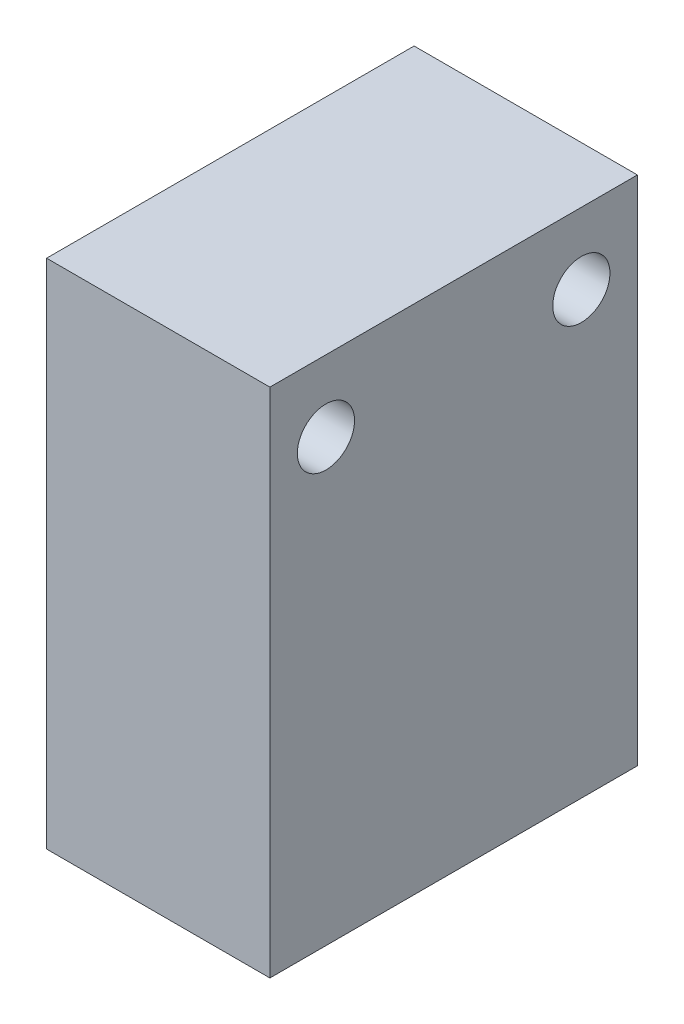
ISO-10303-21;
HEADER;
FILE_DESCRIPTION(('STEP AP214'),'2;1');
FILE_NAME('part.step','',(''),(''),'','','');
FILE_SCHEMA(('AUTOMOTIVE_DESIGN { 1 0 10303 214 1 1 1 1 }'));
ENDSEC;
DATA;
#1=APPLICATION_CONTEXT('core data for automotive mechanical design processes');
#2=APPLICATION_PROTOCOL_DEFINITION('international standard','automotive_design',2000,#1);
#3=PRODUCT_CONTEXT('',#1,'mechanical');
#4=PRODUCT('Part','Part','',(#3));
#5=PRODUCT_RELATED_PRODUCT_CATEGORY('part','',(#4));
#6=PRODUCT_DEFINITION_FORMATION('','',#4);
#7=PRODUCT_DEFINITION_CONTEXT('part definition',#1,'design');
#8=PRODUCT_DEFINITION('design','',#6,#7);
#9=PRODUCT_DEFINITION_SHAPE('','',#8);
#10=(LENGTH_UNIT() NAMED_UNIT(*) SI_UNIT(.MILLI.,.METRE.));
#11=(NAMED_UNIT(*) PLANE_ANGLE_UNIT() SI_UNIT($,.RADIAN.));
#12=(NAMED_UNIT(*) SI_UNIT($,.STERADIAN.) SOLID_ANGLE_UNIT());
#13=UNCERTAINTY_MEASURE_WITH_UNIT(LENGTH_MEASURE(1.E-05),#10,'distance_accuracy_value','');
#14=(GEOMETRIC_REPRESENTATION_CONTEXT(3) GLOBAL_UNCERTAINTY_ASSIGNED_CONTEXT((#13)) GLOBAL_UNIT_ASSIGNED_CONTEXT((#10,
#11,#12)) REPRESENTATION_CONTEXT('',''));
#15=CARTESIAN_POINT('',(0.,0.,0.));
#16=DIRECTION('',(0.,0.,1.));
#17=DIRECTION('',(1.,0.,0.));
#18=AXIS2_PLACEMENT_3D('',#15,#16,#17);
#19=CARTESIAN_POINT('',(6.096,27.94,10.033));
#20=DIRECTION('',(-1.,0.,0.));
#21=DIRECTION('',(0.,0.,1.));
#22=AXIS2_PLACEMENT_3D('',#19,#20,#21);
#23=PLANE('',#22);
#24=CARTESIAN_POINT('',(6.096,24.0538,-6.9723));
#25=DIRECTION('',(-1.,0.,0.));
#26=DIRECTION('',(0.,0.,1.));
#27=AXIS2_PLACEMENT_3D('',#24,#25,#26);
#28=CIRCLE('',#27,1.5621);
#29=CARTESIAN_POINT('',(6.096,24.0538,-5.4102));
#30=VERTEX_POINT('',#29);
#31=EDGE_CURVE('E126',#30,#30,#28,.T.);
#32=ORIENTED_EDGE('',*,*,#31,.T.);
#33=EDGE_LOOP('',(#32));
#34=FACE_BOUND('',#33,.T.);
#35=CARTESIAN_POINT('',(6.096,24.0538,6.9723));
#36=DIRECTION('',(-1.,0.,0.));
#37=DIRECTION('',(0.,0.,1.));
#38=AXIS2_PLACEMENT_3D('',#35,#36,#37);
#39=CIRCLE('',#38,1.5621);
#40=CARTESIAN_POINT('',(6.096,24.0538,8.5344));
#41=VERTEX_POINT('',#40);
#42=EDGE_CURVE('E133',#41,#41,#39,.T.);
#43=ORIENTED_EDGE('',*,*,#42,.T.);
#44=EDGE_LOOP('',(#43));
#45=FACE_BOUND('',#44,.T.);
#46=DIRECTION('',(0.,0.,-1.));
#47=VECTOR('',#46,1.);
#48=CARTESIAN_POINT('',(6.096,0.,10.033));
#49=LINE('',#48,#47);
#50=CARTESIAN_POINT('',(6.096,0.,10.033));
#51=VERTEX_POINT('',#50);
#52=CARTESIAN_POINT('',(6.096,0.,-10.033));
#53=VERTEX_POINT('',#52);
#54=EDGE_CURVE('E110',#51,#53,#49,.T.);
#55=ORIENTED_EDGE('',*,*,#54,.T.);
#56=DIRECTION('',(0.,-1.,0.));
#57=VECTOR('',#56,1.);
#58=CARTESIAN_POINT('',(6.096,27.94,-10.033));
#59=LINE('',#58,#57);
#60=CARTESIAN_POINT('',(6.096,27.94,-10.033));
#61=VERTEX_POINT('',#60);
#62=EDGE_CURVE('E11',#61,#53,#59,.T.);
#63=ORIENTED_EDGE('',*,*,#62,.F.);
#64=DIRECTION('',(0.,0.,-1.));
#65=VECTOR('',#64,1.);
#66=CARTESIAN_POINT('',(6.096,27.94,10.033));
#67=LINE('',#66,#65);
#68=CARTESIAN_POINT('',(6.096,27.94,10.033));
#69=VERTEX_POINT('',#68);
#70=EDGE_CURVE('E93',#69,#61,#67,.T.);
#71=ORIENTED_EDGE('',*,*,#70,.F.);
#72=DIRECTION('',(0.,-1.,0.));
#73=VECTOR('',#72,1.);
#74=CARTESIAN_POINT('',(6.096,27.94,10.033));
#75=LINE('',#74,#73);
#76=EDGE_CURVE('E106',#69,#51,#75,.T.);
#77=ORIENTED_EDGE('',*,*,#76,.T.);
#78=EDGE_LOOP('',(#55,#63,#71,#77));
#79=FACE_BOUND('',#78,.T.);
#80=ADVANCED_FACE('F39',(#34,#45,#79),#23,.F.);
#81=CARTESIAN_POINT('',(-6.096,27.94,-10.033));
#82=DIRECTION('',(0.,0.,1.));
#83=DIRECTION('',(1.,0.,0.));
#84=AXIS2_PLACEMENT_3D('',#81,#82,#83);
#85=PLANE('',#84);
#86=DIRECTION('',(-1.,0.,0.));
#87=VECTOR('',#86,1.);
#88=CARTESIAN_POINT('',(-6.096,0.,-10.033));
#89=LINE('',#88,#87);
#90=CARTESIAN_POINT('',(-6.096,0.,-10.033));
#91=VERTEX_POINT('',#90);
#92=EDGE_CURVE('E98',#53,#91,#89,.T.);
#93=ORIENTED_EDGE('',*,*,#92,.T.);
#94=DIRECTION('',(0.,-1.,0.));
#95=VECTOR('',#94,1.);
#96=CARTESIAN_POINT('',(-6.096,27.94,-10.033));
#97=LINE('',#96,#95);
#98=CARTESIAN_POINT('',(-6.096,27.94,-10.033));
#99=VERTEX_POINT('',#98);
#100=EDGE_CURVE('E49',#99,#91,#97,.T.);
#101=ORIENTED_EDGE('',*,*,#100,.F.);
#102=DIRECTION('',(-1.,0.,0.));
#103=VECTOR('',#102,1.);
#104=CARTESIAN_POINT('',(-6.096,27.94,-10.033));
#105=LINE('',#104,#103);
#106=EDGE_CURVE('E88',#61,#99,#105,.T.);
#107=ORIENTED_EDGE('',*,*,#106,.F.);
#108=ORIENTED_EDGE('',*,*,#62,.T.);
#109=EDGE_LOOP('',(#93,#101,#107,#108));
#110=FACE_BOUND('',#109,.T.);
#111=ADVANCED_FACE('F97',(#110),#85,.F.);
#112=CARTESIAN_POINT('',(-6.096,27.94,10.033));
#113=DIRECTION('',(1.,0.,0.));
#114=DIRECTION('',(0.,0.,-1.));
#115=AXIS2_PLACEMENT_3D('',#112,#113,#114);
#116=PLANE('',#115);
#117=CARTESIAN_POINT('',(-6.096,24.0538,-6.9723));
#118=DIRECTION('',(1.,0.,0.));
#119=DIRECTION('',(0.,0.,-1.));
#120=AXIS2_PLACEMENT_3D('',#117,#118,#119);
#121=CIRCLE('',#120,1.5621);
#122=CARTESIAN_POINT('',(-6.096,24.0538,-8.5344));
#123=VERTEX_POINT('',#122);
#124=EDGE_CURVE('E42',#123,#123,#121,.T.);
#125=ORIENTED_EDGE('',*,*,#124,.T.);
#126=EDGE_LOOP('',(#125));
#127=FACE_BOUND('',#126,.T.);
#128=CARTESIAN_POINT('',(-6.096,24.0538,6.9723));
#129=DIRECTION('',(1.,0.,0.));
#130=DIRECTION('',(0.,0.,-1.));
#131=AXIS2_PLACEMENT_3D('',#128,#129,#130);
#132=CIRCLE('',#131,1.5621);
#133=CARTESIAN_POINT('',(-6.096,24.0538,5.4102));
#134=VERTEX_POINT('',#133);
#135=EDGE_CURVE('E123',#134,#134,#132,.T.);
#136=ORIENTED_EDGE('',*,*,#135,.T.);
#137=EDGE_LOOP('',(#136));
#138=FACE_BOUND('',#137,.T.);
#139=DIRECTION('',(0.,0.,1.));
#140=VECTOR('',#139,1.);
#141=CARTESIAN_POINT('',(-6.096,0.,10.033));
#142=LINE('',#141,#140);
#143=CARTESIAN_POINT('',(-6.096,0.,10.033));
#144=VERTEX_POINT('',#143);
#145=EDGE_CURVE('E75',#91,#144,#142,.T.);
#146=ORIENTED_EDGE('',*,*,#145,.T.);
#147=DIRECTION('',(0.,-1.,0.));
#148=VECTOR('',#147,1.);
#149=CARTESIAN_POINT('',(-6.096,27.94,10.033));
#150=LINE('',#149,#148);
#151=CARTESIAN_POINT('',(-6.096,27.94,10.033));
#152=VERTEX_POINT('',#151);
#153=EDGE_CURVE('E100',#152,#144,#150,.T.);
#154=ORIENTED_EDGE('',*,*,#153,.F.);
#155=DIRECTION('',(0.,0.,1.));
#156=VECTOR('',#155,1.);
#157=CARTESIAN_POINT('',(-6.096,27.94,10.033));
#158=LINE('',#157,#156);
#159=EDGE_CURVE('E91',#99,#152,#158,.T.);
#160=ORIENTED_EDGE('',*,*,#159,.F.);
#161=ORIENTED_EDGE('',*,*,#100,.T.);
#162=EDGE_LOOP('',(#146,#154,#160,#161));
#163=FACE_BOUND('',#162,.T.);
#164=ADVANCED_FACE('F102',(#127,#138,#163),#116,.F.);
#165=CARTESIAN_POINT('',(-6.096,27.94,10.033));
#166=DIRECTION('',(0.,0.,-1.));
#167=DIRECTION('',(-1.,0.,0.));
#168=AXIS2_PLACEMENT_3D('',#165,#166,#167);
#169=PLANE('',#168);
#170=DIRECTION('',(1.,0.,0.));
#171=VECTOR('',#170,1.);
#172=CARTESIAN_POINT('',(-6.096,0.,10.033));
#173=LINE('',#172,#171);
#174=EDGE_CURVE('E81',#144,#51,#173,.T.);
#175=ORIENTED_EDGE('',*,*,#174,.T.);
#176=ORIENTED_EDGE('',*,*,#76,.F.);
#177=DIRECTION('',(1.,0.,0.));
#178=VECTOR('',#177,1.);
#179=CARTESIAN_POINT('',(-6.096,27.94,10.033));
#180=LINE('',#179,#178);
#181=EDGE_CURVE('E58',#152,#69,#180,.T.);
#182=ORIENTED_EDGE('',*,*,#181,.F.);
#183=ORIENTED_EDGE('',*,*,#153,.T.);
#184=EDGE_LOOP('',(#175,#176,#182,#183));
#185=FACE_BOUND('',#184,.T.);
#186=ADVANCED_FACE('F167',(#185),#169,.F.);
#187=CARTESIAN_POINT('',(0.,27.94,0.));
#188=DIRECTION('',(0.,-1.,0.));
#189=DIRECTION('',(0.,0.,-1.));
#190=AXIS2_PLACEMENT_3D('',#187,#188,#189);
#191=PLANE('',#190);
#192=ORIENTED_EDGE('',*,*,#70,.T.);
#193=ORIENTED_EDGE('',*,*,#106,.T.);
#194=ORIENTED_EDGE('',*,*,#159,.T.);
#195=ORIENTED_EDGE('',*,*,#181,.T.);
#196=EDGE_LOOP('',(#192,#193,#194,#195));
#197=FACE_BOUND('',#196,.T.);
#198=ADVANCED_FACE('F89',(#197),#191,.F.);
#199=CARTESIAN_POINT('',(0.,0.,0.));
#200=DIRECTION('',(0.,-1.,0.));
#201=DIRECTION('',(0.,0.,-1.));
#202=AXIS2_PLACEMENT_3D('',#199,#200,#201);
#203=PLANE('',#202);
#204=ORIENTED_EDGE('',*,*,#54,.F.);
#205=ORIENTED_EDGE('',*,*,#174,.F.);
#206=ORIENTED_EDGE('',*,*,#145,.F.);
#207=ORIENTED_EDGE('',*,*,#92,.F.);
#208=EDGE_LOOP('',(#204,#205,#206,#207));
#209=FACE_BOUND('',#208,.T.);
#210=ADVANCED_FACE('F149',(#209),#203,.T.);
#211=CARTESIAN_POINT('',(6.096,24.0538,6.9723));
#212=DIRECTION('',(-1.,0.,0.));
#213=DIRECTION('',(0.,0.,1.));
#214=AXIS2_PLACEMENT_3D('',#211,#212,#213);
#215=CYLINDRICAL_SURFACE('',#214,1.5621);
#216=ORIENTED_EDGE('',*,*,#42,.F.);
#217=EDGE_LOOP('',(#216));
#218=FACE_BOUND('',#217,.T.);
#219=ORIENTED_EDGE('',*,*,#135,.F.);
#220=EDGE_LOOP('',(#219));
#221=FACE_BOUND('',#220,.T.);
#222=ADVANCED_FACE('F145',(#218,#221),#215,.F.);
#223=CARTESIAN_POINT('',(6.096,24.0538,-6.9723));
#224=DIRECTION('',(-1.,0.,0.));
#225=DIRECTION('',(0.,0.,1.));
#226=AXIS2_PLACEMENT_3D('',#223,#224,#225);
#227=CYLINDRICAL_SURFACE('',#226,1.5621);
#228=ORIENTED_EDGE('',*,*,#31,.F.);
#229=EDGE_LOOP('',(#228));
#230=FACE_BOUND('',#229,.T.);
#231=ORIENTED_EDGE('',*,*,#124,.F.);
#232=EDGE_LOOP('',(#231));
#233=FACE_BOUND('',#232,.T.);
#234=ADVANCED_FACE('F148',(#230,#233),#227,.F.);
#235=CLOSED_SHELL('',(#80,#111,#164,#186,#198,#210,#222,#234));
#236=MANIFOLD_SOLID_BREP('B2',#235);
#237=ADVANCED_BREP_SHAPE_REPRESENTATION('',(#18,#236),#14);
#238=SHAPE_DEFINITION_REPRESENTATION(#9,#237);
ENDSEC;
END-ISO-10303-21;
